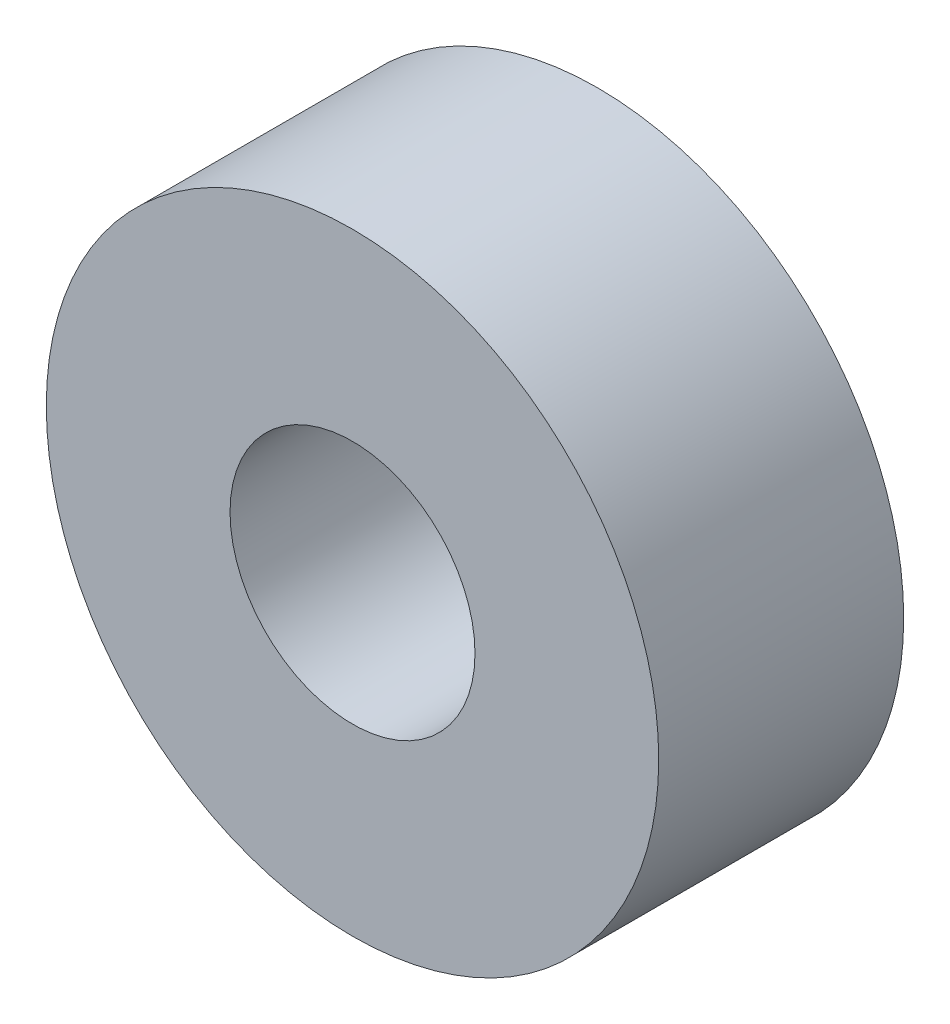
ISO-10303-21;
HEADER;
FILE_DESCRIPTION(('STEP AP214'),'2;1');
FILE_NAME('part.step','',(''),(''),'','','');
FILE_SCHEMA(('AUTOMOTIVE_DESIGN { 1 0 10303 214 1 1 1 1 }'));
ENDSEC;
DATA;
#1=APPLICATION_CONTEXT('core data for automotive mechanical design processes');
#2=APPLICATION_PROTOCOL_DEFINITION('international standard','automotive_design',2000,#1);
#3=PRODUCT_CONTEXT('',#1,'mechanical');
#4=PRODUCT('Part','Part','',(#3));
#5=PRODUCT_RELATED_PRODUCT_CATEGORY('part','',(#4));
#6=PRODUCT_DEFINITION_FORMATION('','',#4);
#7=PRODUCT_DEFINITION_CONTEXT('part definition',#1,'design');
#8=PRODUCT_DEFINITION('design','',#6,#7);
#9=PRODUCT_DEFINITION_SHAPE('','',#8);
#10=(LENGTH_UNIT() NAMED_UNIT(*) SI_UNIT(.MILLI.,.METRE.));
#11=(NAMED_UNIT(*) PLANE_ANGLE_UNIT() SI_UNIT($,.RADIAN.));
#12=(NAMED_UNIT(*) SI_UNIT($,.STERADIAN.) SOLID_ANGLE_UNIT());
#13=UNCERTAINTY_MEASURE_WITH_UNIT(LENGTH_MEASURE(1.E-05),#10,'distance_accuracy_value','');
#14=(GEOMETRIC_REPRESENTATION_CONTEXT(3) GLOBAL_UNCERTAINTY_ASSIGNED_CONTEXT((#13)) GLOBAL_UNIT_ASSIGNED_CONTEXT((#10,
#11,#12)) REPRESENTATION_CONTEXT('',''));
#15=CARTESIAN_POINT('',(0.,0.,0.));
#16=DIRECTION('',(0.,0.,1.));
#17=DIRECTION('',(1.,0.,0.));
#18=AXIS2_PLACEMENT_3D('',#15,#16,#17);
#19=CARTESIAN_POINT('',(0.,0.,2.));
#20=DIRECTION('',(0.,0.,1.));
#21=DIRECTION('',(1.,0.,0.));
#22=AXIS2_PLACEMENT_3D('',#19,#20,#21);
#23=PLANE('',#22);
#24=CARTESIAN_POINT('',(0.,0.,2.));
#25=DIRECTION('',(0.,0.,1.));
#26=DIRECTION('',(1.,0.,0.));
#27=AXIS2_PLACEMENT_3D('',#24,#25,#26);
#28=CIRCLE('',#27,5.);
#29=CARTESIAN_POINT('',(5.,0.,2.));
#30=VERTEX_POINT('',#29);
#31=EDGE_CURVE('E10',#30,#30,#28,.T.);
#32=ORIENTED_EDGE('',*,*,#31,.T.);
#33=EDGE_LOOP('',(#32));
#34=FACE_BOUND('',#33,.T.);
#35=CARTESIAN_POINT('',(0.,0.,2.));
#36=DIRECTION('',(0.,0.,1.));
#37=DIRECTION('',(1.,0.,0.));
#38=AXIS2_PLACEMENT_3D('',#35,#36,#37);
#39=CIRCLE('',#38,2.);
#40=CARTESIAN_POINT('',(2.,0.,2.));
#41=VERTEX_POINT('',#40);
#42=EDGE_CURVE('E41',#41,#41,#39,.T.);
#43=ORIENTED_EDGE('',*,*,#42,.F.);
#44=EDGE_LOOP('',(#43));
#45=FACE_BOUND('',#44,.T.);
#46=ADVANCED_FACE('F30',(#34,#45),#23,.T.);
#47=CARTESIAN_POINT('',(0.,0.,-2.));
#48=DIRECTION('',(0.,0.,1.));
#49=DIRECTION('',(1.,0.,0.));
#50=AXIS2_PLACEMENT_3D('',#47,#48,#49);
#51=PLANE('',#50);
#52=CARTESIAN_POINT('',(0.,0.,-2.));
#53=DIRECTION('',(0.,0.,1.));
#54=DIRECTION('',(1.,0.,0.));
#55=AXIS2_PLACEMENT_3D('',#52,#53,#54);
#56=CIRCLE('',#55,5.);
#57=CARTESIAN_POINT('',(5.,0.,-2.));
#58=VERTEX_POINT('',#57);
#59=EDGE_CURVE('E34',#58,#58,#56,.T.);
#60=ORIENTED_EDGE('',*,*,#59,.F.);
#61=EDGE_LOOP('',(#60));
#62=FACE_BOUND('',#61,.T.);
#63=CARTESIAN_POINT('',(0.,0.,-2.));
#64=DIRECTION('',(0.,0.,1.));
#65=DIRECTION('',(1.,0.,0.));
#66=AXIS2_PLACEMENT_3D('',#63,#64,#65);
#67=CIRCLE('',#66,2.);
#68=CARTESIAN_POINT('',(2.,0.,-2.));
#69=VERTEX_POINT('',#68);
#70=EDGE_CURVE('E43',#69,#69,#67,.T.);
#71=ORIENTED_EDGE('',*,*,#70,.T.);
#72=EDGE_LOOP('',(#71));
#73=FACE_BOUND('',#72,.T.);
#74=ADVANCED_FACE('F53',(#62,#73),#51,.F.);
#75=CARTESIAN_POINT('',(0.,0.,2.));
#76=DIRECTION('',(0.,0.,-1.));
#77=DIRECTION('',(-1.,0.,0.));
#78=AXIS2_PLACEMENT_3D('',#75,#76,#77);
#79=CYLINDRICAL_SURFACE('',#78,5.);
#80=ORIENTED_EDGE('',*,*,#31,.F.);
#81=EDGE_LOOP('',(#80));
#82=FACE_BOUND('',#81,.T.);
#83=ORIENTED_EDGE('',*,*,#59,.T.);
#84=EDGE_LOOP('',(#83));
#85=FACE_BOUND('',#84,.T.);
#86=ADVANCED_FACE('F32',(#82,#85),#79,.T.);
#87=CARTESIAN_POINT('',(0.,0.,2.));
#88=DIRECTION('',(0.,0.,-1.));
#89=DIRECTION('',(-1.,0.,0.));
#90=AXIS2_PLACEMENT_3D('',#87,#88,#89);
#91=CYLINDRICAL_SURFACE('',#90,2.);
#92=ORIENTED_EDGE('',*,*,#42,.T.);
#93=EDGE_LOOP('',(#92));
#94=FACE_BOUND('',#93,.T.);
#95=ORIENTED_EDGE('',*,*,#70,.F.);
#96=EDGE_LOOP('',(#95));
#97=FACE_BOUND('',#96,.T.);
#98=ADVANCED_FACE('F49',(#94,#97),#91,.F.);
#99=CLOSED_SHELL('',(#46,#74,#86,#98));
#100=MANIFOLD_SOLID_BREP('B2',#99);
#101=ADVANCED_BREP_SHAPE_REPRESENTATION('',(#18,#100),#14);
#102=SHAPE_DEFINITION_REPRESENTATION(#9,#101);
ENDSEC;
END-ISO-10303-21;
